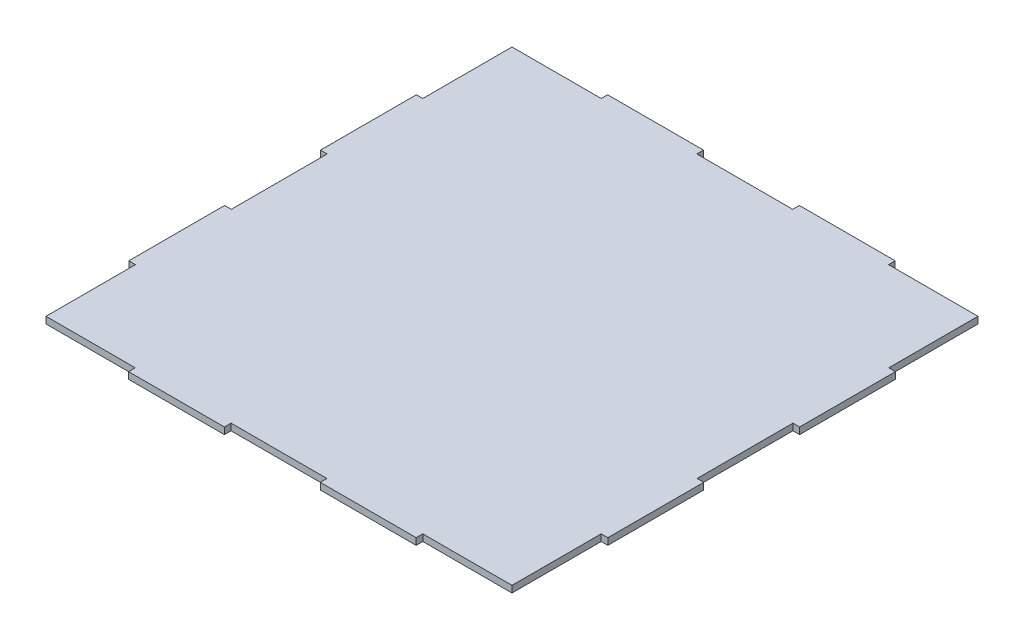
ISO-10303-21;
HEADER;
FILE_DESCRIPTION(('STEP AP214'),'2;1');
FILE_NAME('part.step','',(''),(''),'','','');
FILE_SCHEMA(('AUTOMOTIVE_DESIGN { 1 0 10303 214 1 1 1 1 }'));
ENDSEC;
DATA;
#1=APPLICATION_CONTEXT('core data for automotive mechanical design processes');
#2=APPLICATION_PROTOCOL_DEFINITION('international standard','automotive_design',2000,#1);
#3=PRODUCT_CONTEXT('',#1,'mechanical');
#4=PRODUCT('Part','Part','',(#3));
#5=PRODUCT_RELATED_PRODUCT_CATEGORY('part','',(#4));
#6=PRODUCT_DEFINITION_FORMATION('','',#4);
#7=PRODUCT_DEFINITION_CONTEXT('part definition',#1,'design');
#8=PRODUCT_DEFINITION('design','',#6,#7);
#9=PRODUCT_DEFINITION_SHAPE('','',#8);
#10=(LENGTH_UNIT() NAMED_UNIT(*) SI_UNIT(.MILLI.,.METRE.));
#11=(NAMED_UNIT(*) PLANE_ANGLE_UNIT() SI_UNIT($,.RADIAN.));
#12=(NAMED_UNIT(*) SI_UNIT($,.STERADIAN.) SOLID_ANGLE_UNIT());
#13=UNCERTAINTY_MEASURE_WITH_UNIT(LENGTH_MEASURE(1.E-05),#10,'distance_accuracy_value','');
#14=(GEOMETRIC_REPRESENTATION_CONTEXT(3) GLOBAL_UNCERTAINTY_ASSIGNED_CONTEXT((#13)) GLOBAL_UNIT_ASSIGNED_CONTEXT((#10,
#11,#12)) REPRESENTATION_CONTEXT('',''));
#15=CARTESIAN_POINT('',(0.,0.,0.));
#16=DIRECTION('',(0.,0.,1.));
#17=DIRECTION('',(1.,0.,0.));
#18=AXIS2_PLACEMENT_3D('',#15,#16,#17);
#19=CARTESIAN_POINT('',(114.3,3.175,-114.3));
#20=DIRECTION('',(0.,0.,1.));
#21=DIRECTION('',(1.,0.,0.));
#22=AXIS2_PLACEMENT_3D('',#19,#20,#21);
#23=PLANE('',#22);
#24=DIRECTION('',(-1.,0.,0.));
#25=VECTOR('',#24,1.);
#26=CARTESIAN_POINT('',(114.3,0.,-114.3));
#27=LINE('',#26,#25);
#28=CARTESIAN_POINT('',(68.4752787902901,0.,-114.3));
#29=VERTEX_POINT('',#28);
#30=CARTESIAN_POINT('',(22.7552787902901,0.,-114.3));
#31=VERTEX_POINT('',#30);
#32=EDGE_CURVE('E312',#29,#31,#27,.T.);
#33=ORIENTED_EDGE('',*,*,#32,.T.);
#34=DIRECTION('',(0.,1.,0.));
#35=VECTOR('',#34,1.);
#36=CARTESIAN_POINT('',(22.7552787902901,-3.175,-114.3));
#37=LINE('',#36,#35);
#38=CARTESIAN_POINT('',(22.7552787902901,3.175,-114.3));
#39=VERTEX_POINT('',#38);
#40=EDGE_CURVE('E399',#31,#39,#37,.T.);
#41=ORIENTED_EDGE('',*,*,#40,.T.);
#42=DIRECTION('',(-1.,0.,0.));
#43=VECTOR('',#42,1.);
#44=CARTESIAN_POINT('',(114.3,3.175,-114.3));
#45=LINE('',#44,#43);
#46=CARTESIAN_POINT('',(68.4752787902901,3.175,-114.3));
#47=VERTEX_POINT('',#46);
#48=EDGE_CURVE('E290',#47,#39,#45,.T.);
#49=ORIENTED_EDGE('',*,*,#48,.F.);
#50=DIRECTION('',(0.,1.,0.));
#51=VECTOR('',#50,1.);
#52=CARTESIAN_POINT('',(68.4752787902901,-3.175,-114.3));
#53=LINE('',#52,#51);
#54=EDGE_CURVE('E535',#29,#47,#53,.T.);
#55=ORIENTED_EDGE('',*,*,#54,.F.);
#56=EDGE_LOOP('',(#33,#41,#49,#55));
#57=FACE_BOUND('',#56,.T.);
#58=ADVANCED_FACE('F34',(#57),#23,.F.);
#59=CARTESIAN_POINT('',(114.3,3.175,114.3));
#60=DIRECTION('',(-1.,0.,0.));
#61=DIRECTION('',(0.,0.,1.));
#62=AXIS2_PLACEMENT_3D('',#59,#60,#61);
#63=PLANE('',#62);
#64=DIRECTION('',(0.,0.,-1.));
#65=VECTOR('',#64,1.);
#66=CARTESIAN_POINT('',(114.3,3.175,114.3));
#67=LINE('',#66,#65);
#68=CARTESIAN_POINT('',(114.3,3.175,-22.86));
#69=VERTEX_POINT('',#68);
#70=CARTESIAN_POINT('',(114.3,3.175,-68.5800000000001));
#71=VERTEX_POINT('',#70);
#72=EDGE_CURVE('E296',#69,#71,#67,.T.);
#73=ORIENTED_EDGE('',*,*,#72,.F.);
#74=DIRECTION('',(0.,1.,0.));
#75=VECTOR('',#74,1.);
#76=CARTESIAN_POINT('',(114.3,-3.175,-22.86));
#77=LINE('',#76,#75);
#78=CARTESIAN_POINT('',(114.3,0.,-22.86));
#79=VERTEX_POINT('',#78);
#80=EDGE_CURVE('E414',#79,#69,#77,.T.);
#81=ORIENTED_EDGE('',*,*,#80,.F.);
#82=DIRECTION('',(0.,0.,-1.));
#83=VECTOR('',#82,1.);
#84=CARTESIAN_POINT('',(114.3,0.,114.3));
#85=LINE('',#84,#83);
#86=CARTESIAN_POINT('',(114.3,0.,-68.5800000000001));
#87=VERTEX_POINT('',#86);
#88=EDGE_CURVE('E307',#79,#87,#85,.T.);
#89=ORIENTED_EDGE('',*,*,#88,.T.);
#90=DIRECTION('',(0.,1.,0.));
#91=VECTOR('',#90,1.);
#92=CARTESIAN_POINT('',(114.3,-3.175,-68.5800000000001));
#93=LINE('',#92,#91);
#94=EDGE_CURVE('E537',#87,#71,#93,.T.);
#95=ORIENTED_EDGE('',*,*,#94,.T.);
#96=EDGE_LOOP('',(#73,#81,#89,#95));
#97=FACE_BOUND('',#96,.T.);
#98=ADVANCED_FACE('F594',(#97),#63,.F.);
#99=CARTESIAN_POINT('',(-114.3,3.175,114.3));
#100=DIRECTION('',(1.,0.,0.));
#101=DIRECTION('',(0.,0.,-1.));
#102=AXIS2_PLACEMENT_3D('',#99,#100,#101);
#103=PLANE('',#102);
#104=DIRECTION('',(0.,0.,1.));
#105=VECTOR('',#104,1.);
#106=CARTESIAN_POINT('',(-114.3,3.175,114.3));
#107=LINE('',#106,#105);
#108=CARTESIAN_POINT('',(-114.299999999999,3.175,22.7552787902902));
#109=VERTEX_POINT('',#108);
#110=CARTESIAN_POINT('',(-114.3,3.175,68.4752787902901));
#111=VERTEX_POINT('',#110);
#112=EDGE_CURVE('E315',#109,#111,#107,.T.);
#113=ORIENTED_EDGE('',*,*,#112,.F.);
#114=DIRECTION('',(0.,1.,0.));
#115=VECTOR('',#114,1.);
#116=CARTESIAN_POINT('',(-114.299999999999,-3.175,22.7552787902902));
#117=LINE('',#116,#115);
#118=CARTESIAN_POINT('',(-114.299999999999,0.,22.7552787902902));
#119=VERTEX_POINT('',#118);
#120=EDGE_CURVE('E477',#119,#109,#117,.T.);
#121=ORIENTED_EDGE('',*,*,#120,.F.);
#122=DIRECTION('',(0.,0.,1.));
#123=VECTOR('',#122,1.);
#124=CARTESIAN_POINT('',(-114.3,0.,114.3));
#125=LINE('',#124,#123);
#126=CARTESIAN_POINT('',(-114.3,0.,68.4752787902901));
#127=VERTEX_POINT('',#126);
#128=EDGE_CURVE('E303',#119,#127,#125,.T.);
#129=ORIENTED_EDGE('',*,*,#128,.T.);
#130=DIRECTION('',(0.,1.,0.));
#131=VECTOR('',#130,1.);
#132=CARTESIAN_POINT('',(-114.3,-3.175,68.4752787902901));
#133=LINE('',#132,#131);
#134=EDGE_CURVE('E515',#127,#111,#133,.T.);
#135=ORIENTED_EDGE('',*,*,#134,.T.);
#136=EDGE_LOOP('',(#113,#121,#129,#135));
#137=FACE_BOUND('',#136,.T.);
#138=ADVANCED_FACE('F628',(#137),#103,.F.);
#139=CARTESIAN_POINT('',(114.3,3.175,114.3));
#140=DIRECTION('',(0.,0.,-1.));
#141=DIRECTION('',(-1.,0.,0.));
#142=AXIS2_PLACEMENT_3D('',#139,#140,#141);
#143=PLANE('',#142);
#144=DIRECTION('',(1.,0.,0.));
#145=VECTOR('',#144,1.);
#146=CARTESIAN_POINT('',(114.3,0.,114.3));
#147=LINE('',#146,#145);
#148=CARTESIAN_POINT('',(-68.58,0.,114.3));
#149=VERTEX_POINT('',#148);
#150=CARTESIAN_POINT('',(-22.86,0.,114.3));
#151=VERTEX_POINT('',#150);
#152=EDGE_CURVE('E304',#149,#151,#147,.T.);
#153=ORIENTED_EDGE('',*,*,#152,.T.);
#154=DIRECTION('',(0.,1.,0.));
#155=VECTOR('',#154,1.);
#156=CARTESIAN_POINT('',(-22.86,-3.175,114.3));
#157=LINE('',#156,#155);
#158=CARTESIAN_POINT('',(-22.86,3.175,114.3));
#159=VERTEX_POINT('',#158);
#160=EDGE_CURVE('E490',#151,#159,#157,.T.);
#161=ORIENTED_EDGE('',*,*,#160,.T.);
#162=DIRECTION('',(1.,0.,0.));
#163=VECTOR('',#162,1.);
#164=CARTESIAN_POINT('',(114.3,3.175,114.3));
#165=LINE('',#164,#163);
#166=CARTESIAN_POINT('',(-68.58,3.175,114.3));
#167=VERTEX_POINT('',#166);
#168=EDGE_CURVE('E547',#167,#159,#165,.T.);
#169=ORIENTED_EDGE('',*,*,#168,.F.);
#170=DIRECTION('',(0.,1.,0.));
#171=VECTOR('',#170,1.);
#172=CARTESIAN_POINT('',(-68.58,-3.175,114.3));
#173=LINE('',#172,#171);
#174=EDGE_CURVE('E512',#149,#167,#173,.T.);
#175=ORIENTED_EDGE('',*,*,#174,.F.);
#176=EDGE_LOOP('',(#153,#161,#169,#175));
#177=FACE_BOUND('',#176,.T.);
#178=ADVANCED_FACE('F640',(#177),#143,.F.);
#179=CARTESIAN_POINT('',(-114.3,3.175,-68.68472120971));
#180=VERTEX_POINT('',#179);
#181=CARTESIAN_POINT('',(-114.299999999999,3.175,-22.9647212097099));
#182=VERTEX_POINT('',#181);
#183=EDGE_CURVE('E545',#180,#182,#107,.T.);
#184=ORIENTED_EDGE('',*,*,#183,.F.);
#185=DIRECTION('',(0.,-1.,0.));
#186=VECTOR('',#185,1.);
#187=CARTESIAN_POINT('',(-114.3,3.175,-68.68472120971));
#188=LINE('',#187,#186);
#189=CARTESIAN_POINT('',(-114.3,0.,-68.68472120971));
#190=VERTEX_POINT('',#189);
#191=EDGE_CURVE('E457',#180,#190,#188,.T.);
#192=ORIENTED_EDGE('',*,*,#191,.T.);
#193=CARTESIAN_POINT('',(-114.3,0.,-22.9647212097099));
#194=VERTEX_POINT('',#193);
#195=EDGE_CURVE('E300',#190,#194,#125,.T.);
#196=ORIENTED_EDGE('',*,*,#195,.T.);
#197=DIRECTION('',(0.,1.,0.));
#198=VECTOR('',#197,1.);
#199=CARTESIAN_POINT('',(-114.299999999999,-3.175,-22.9647212097099));
#200=LINE('',#199,#198);
#201=EDGE_CURVE('E479',#194,#182,#200,.T.);
#202=ORIENTED_EDGE('',*,*,#201,.T.);
#203=EDGE_LOOP('',(#184,#192,#196,#202));
#204=FACE_BOUND('',#203,.T.);
#205=ADVANCED_FACE('F36',(#204),#103,.F.);
#206=CARTESIAN_POINT('',(22.86,0.,114.3));
#207=VERTEX_POINT('',#206);
#208=CARTESIAN_POINT('',(68.58,0.,114.3));
#209=VERTEX_POINT('',#208);
#210=EDGE_CURVE('E302',#207,#209,#147,.T.);
#211=ORIENTED_EDGE('',*,*,#210,.T.);
#212=DIRECTION('',(0.,1.,0.));
#213=VECTOR('',#212,1.);
#214=CARTESIAN_POINT('',(68.58,-3.175,114.3));
#215=LINE('',#214,#213);
#216=CARTESIAN_POINT('',(68.58,3.175,114.3));
#217=VERTEX_POINT('',#216);
#218=EDGE_CURVE('E440',#209,#217,#215,.T.);
#219=ORIENTED_EDGE('',*,*,#218,.T.);
#220=CARTESIAN_POINT('',(22.86,3.175,114.3));
#221=VERTEX_POINT('',#220);
#222=EDGE_CURVE('E546',#221,#217,#165,.T.);
#223=ORIENTED_EDGE('',*,*,#222,.F.);
#224=DIRECTION('',(0.,1.,0.));
#225=VECTOR('',#224,1.);
#226=CARTESIAN_POINT('',(22.86,-3.175,114.3));
#227=LINE('',#226,#225);
#228=EDGE_CURVE('E496',#207,#221,#227,.T.);
#229=ORIENTED_EDGE('',*,*,#228,.F.);
#230=EDGE_LOOP('',(#211,#219,#223,#229));
#231=FACE_BOUND('',#230,.T.);
#232=ADVANCED_FACE('F561',(#231),#143,.F.);
#233=CARTESIAN_POINT('',(114.3,0.,68.5799999999999));
#234=VERTEX_POINT('',#233);
#235=CARTESIAN_POINT('',(114.3,0.,22.86));
#236=VERTEX_POINT('',#235);
#237=EDGE_CURVE('E308',#234,#236,#85,.T.);
#238=ORIENTED_EDGE('',*,*,#237,.T.);
#239=DIRECTION('',(0.,1.,0.));
#240=VECTOR('',#239,1.);
#241=CARTESIAN_POINT('',(114.3,-3.175,22.86));
#242=LINE('',#241,#240);
#243=CARTESIAN_POINT('',(114.3,3.175,22.86));
#244=VERTEX_POINT('',#243);
#245=EDGE_CURVE('E417',#236,#244,#242,.T.);
#246=ORIENTED_EDGE('',*,*,#245,.T.);
#247=CARTESIAN_POINT('',(114.3,3.175,68.5799999999999));
#248=VERTEX_POINT('',#247);
#249=EDGE_CURVE('E291',#248,#244,#67,.T.);
#250=ORIENTED_EDGE('',*,*,#249,.F.);
#251=DIRECTION('',(0.,1.,0.));
#252=VECTOR('',#251,1.);
#253=CARTESIAN_POINT('',(114.3,-3.175,68.5799999999999));
#254=LINE('',#253,#252);
#255=EDGE_CURVE('E438',#234,#248,#254,.T.);
#256=ORIENTED_EDGE('',*,*,#255,.F.);
#257=EDGE_LOOP('',(#238,#246,#250,#256));
#258=FACE_BOUND('',#257,.T.);
#259=ADVANCED_FACE('F579',(#258),#63,.F.);
#260=CARTESIAN_POINT('',(-22.9647212097099,3.175,-114.3));
#261=VERTEX_POINT('',#260);
#262=CARTESIAN_POINT('',(-68.6847212097096,3.175,-114.3));
#263=VERTEX_POINT('',#262);
#264=EDGE_CURVE('E281',#261,#263,#45,.T.);
#265=ORIENTED_EDGE('',*,*,#264,.F.);
#266=DIRECTION('',(0.,1.,0.));
#267=VECTOR('',#266,1.);
#268=CARTESIAN_POINT('',(-22.9647212097099,-3.175,-114.3));
#269=LINE('',#268,#267);
#270=CARTESIAN_POINT('',(-22.9647212097099,0.,-114.3));
#271=VERTEX_POINT('',#270);
#272=EDGE_CURVE('E265',#271,#261,#269,.T.);
#273=ORIENTED_EDGE('',*,*,#272,.F.);
#274=CARTESIAN_POINT('',(-68.6847212097096,0.,-114.3));
#275=VERTEX_POINT('',#274);
#276=EDGE_CURVE('E311',#271,#275,#27,.T.);
#277=ORIENTED_EDGE('',*,*,#276,.T.);
#278=DIRECTION('',(0.,1.,0.));
#279=VECTOR('',#278,1.);
#280=CARTESIAN_POINT('',(-68.6847212097096,-3.175,-114.3));
#281=LINE('',#280,#279);
#282=EDGE_CURVE('E289',#275,#263,#281,.T.);
#283=ORIENTED_EDGE('',*,*,#282,.T.);
#284=EDGE_LOOP('',(#265,#273,#277,#283));
#285=FACE_BOUND('',#284,.T.);
#286=ADVANCED_FACE('F287',(#285),#23,.F.);
#287=CARTESIAN_POINT('',(0.,3.175,0.));
#288=DIRECTION('',(0.,1.,0.));
#289=DIRECTION('',(0.,0.,1.));
#290=AXIS2_PLACEMENT_3D('',#287,#288,#289);
#291=PLANE('',#290);
#292=DIRECTION('',(0.,0.,-1.));
#293=VECTOR('',#292,1.);
#294=CARTESIAN_POINT('',(22.7552787902901,3.175,-114.3));
#295=LINE('',#294,#293);
#296=CARTESIAN_POINT('',(22.7552787902901,3.175,-111.125));
#297=VERTEX_POINT('',#296);
#298=EDGE_CURVE('E275',#297,#39,#295,.T.);
#299=ORIENTED_EDGE('',*,*,#298,.F.);
#300=DIRECTION('',(1.,0.,0.));
#301=VECTOR('',#300,1.);
#302=CARTESIAN_POINT('',(-22.9647212097099,3.175,-111.125));
#303=LINE('',#302,#301);
#304=CARTESIAN_POINT('',(-22.9647212097099,3.175,-111.125));
#305=VERTEX_POINT('',#304);
#306=EDGE_CURVE('E284',#305,#297,#303,.T.);
#307=ORIENTED_EDGE('',*,*,#306,.F.);
#308=DIRECTION('',(0.,0.,1.));
#309=VECTOR('',#308,1.);
#310=CARTESIAN_POINT('',(-22.9647212097099,3.175,-114.3));
#311=LINE('',#310,#309);
#312=EDGE_CURVE('E268',#261,#305,#311,.T.);
#313=ORIENTED_EDGE('',*,*,#312,.F.);
#314=ORIENTED_EDGE('',*,*,#264,.T.);
#315=DIRECTION('',(0.,0.,-1.));
#316=VECTOR('',#315,1.);
#317=CARTESIAN_POINT('',(-68.6847212097096,3.175,-111.22972120971));
#318=LINE('',#317,#316);
#319=CARTESIAN_POINT('',(-68.6847212097096,3.175,-111.22972120971));
#320=VERTEX_POINT('',#319);
#321=EDGE_CURVE('E446',#320,#263,#318,.T.);
#322=ORIENTED_EDGE('',*,*,#321,.F.);
#323=DIRECTION('',(1.,0.,0.));
#324=VECTOR('',#323,1.);
#325=CARTESIAN_POINT('',(-68.6847212097096,3.175,-111.22972120971));
#326=LINE('',#325,#324);
#327=CARTESIAN_POINT('',(-111.229721209707,3.175,-111.22972120971));
#328=VERTEX_POINT('',#327);
#329=EDGE_CURVE('E435',#328,#320,#326,.T.);
#330=ORIENTED_EDGE('',*,*,#329,.F.);
#331=DIRECTION('',(0.,0.,-1.));
#332=VECTOR('',#331,1.);
#333=CARTESIAN_POINT('',(-111.229721209707,3.175,-111.22972120971));
#334=LINE('',#333,#332);
#335=CARTESIAN_POINT('',(-111.229721209707,3.175,-68.68472120971));
#336=VERTEX_POINT('',#335);
#337=EDGE_CURVE('E451',#336,#328,#334,.T.);
#338=ORIENTED_EDGE('',*,*,#337,.F.);
#339=DIRECTION('',(1.,0.,0.));
#340=VECTOR('',#339,1.);
#341=CARTESIAN_POINT('',(-111.229721209707,3.175,-68.68472120971));
#342=LINE('',#341,#340);
#343=EDGE_CURVE('E448',#180,#336,#342,.T.);
#344=ORIENTED_EDGE('',*,*,#343,.F.);
#345=ORIENTED_EDGE('',*,*,#183,.T.);
#346=DIRECTION('',(-1.,0.,0.));
#347=VECTOR('',#346,1.);
#348=CARTESIAN_POINT('',(-111.125000000008,3.175,-22.9647212097099));
#349=LINE('',#348,#347);
#350=CARTESIAN_POINT('',(-111.125000000008,3.175,-22.9647212097099));
#351=VERTEX_POINT('',#350);
#352=EDGE_CURVE('E467',#351,#182,#349,.T.);
#353=ORIENTED_EDGE('',*,*,#352,.F.);
#354=DIRECTION('',(0.,0.,-1.));
#355=VECTOR('',#354,1.);
#356=CARTESIAN_POINT('',(-111.125000000008,3.175,-22.9647212097099));
#357=LINE('',#356,#355);
#358=CARTESIAN_POINT('',(-111.125000000008,3.175,22.7552787902902));
#359=VERTEX_POINT('',#358);
#360=EDGE_CURVE('E464',#359,#351,#357,.T.);
#361=ORIENTED_EDGE('',*,*,#360,.F.);
#362=DIRECTION('',(1.,0.,0.));
#363=VECTOR('',#362,1.);
#364=CARTESIAN_POINT('',(-111.125000000008,3.175,22.7552787902902));
#365=LINE('',#364,#363);
#366=EDGE_CURVE('E470',#109,#359,#365,.T.);
#367=ORIENTED_EDGE('',*,*,#366,.F.);
#368=ORIENTED_EDGE('',*,*,#112,.T.);
#369=DIRECTION('',(-1.,0.,0.));
#370=VECTOR('',#369,1.);
#371=CARTESIAN_POINT('',(-111.125,3.175,68.4752787902901));
#372=LINE('',#371,#370);
#373=CARTESIAN_POINT('',(-111.125,3.175,68.4752787902901));
#374=VERTEX_POINT('',#373);
#375=EDGE_CURVE('E508',#374,#111,#372,.T.);
#376=ORIENTED_EDGE('',*,*,#375,.F.);
#377=DIRECTION('',(0.,0.,-1.));
#378=VECTOR('',#377,1.);
#379=CARTESIAN_POINT('',(-111.125,3.175,68.4752787902901));
#380=LINE('',#379,#378);
#381=CARTESIAN_POINT('',(-111.125,3.175,111.125));
#382=VERTEX_POINT('',#381);
#383=EDGE_CURVE('E505',#382,#374,#380,.T.);
#384=ORIENTED_EDGE('',*,*,#383,.F.);
#385=DIRECTION('',(-1.,0.,0.));
#386=VECTOR('',#385,1.);
#387=CARTESIAN_POINT('',(-111.125,3.175,111.125));
#388=LINE('',#387,#386);
#389=CARTESIAN_POINT('',(-68.58,3.175,111.125));
#390=VERTEX_POINT('',#389);
#391=EDGE_CURVE('E502',#390,#382,#388,.T.);
#392=ORIENTED_EDGE('',*,*,#391,.F.);
#393=DIRECTION('',(0.,0.,-1.));
#394=VECTOR('',#393,1.);
#395=CARTESIAN_POINT('',(-68.58,3.175,111.125));
#396=LINE('',#395,#394);
#397=EDGE_CURVE('E493',#167,#390,#396,.T.);
#398=ORIENTED_EDGE('',*,*,#397,.F.);
#399=ORIENTED_EDGE('',*,*,#168,.T.);
#400=DIRECTION('',(0.,0.,1.));
#401=VECTOR('',#400,1.);
#402=CARTESIAN_POINT('',(-22.86,3.175,114.3));
#403=LINE('',#402,#401);
#404=CARTESIAN_POINT('',(-22.86,3.175,111.125));
#405=VERTEX_POINT('',#404);
#406=EDGE_CURVE('E476',#405,#159,#403,.T.);
#407=ORIENTED_EDGE('',*,*,#406,.F.);
#408=DIRECTION('',(-1.,0.,0.));
#409=VECTOR('',#408,1.);
#410=CARTESIAN_POINT('',(-22.86,3.175,111.125));
#411=LINE('',#410,#409);
#412=CARTESIAN_POINT('',(22.86,3.175,111.125));
#413=VERTEX_POINT('',#412);
#414=EDGE_CURVE('E487',#413,#405,#411,.T.);
#415=ORIENTED_EDGE('',*,*,#414,.F.);
#416=DIRECTION('',(0.,0.,-1.));
#417=VECTOR('',#416,1.);
#418=CARTESIAN_POINT('',(22.86,3.175,114.3));
#419=LINE('',#418,#417);
#420=EDGE_CURVE('E484',#221,#413,#419,.T.);
#421=ORIENTED_EDGE('',*,*,#420,.F.);
#422=ORIENTED_EDGE('',*,*,#222,.T.);
#423=DIRECTION('',(0.,0.,1.));
#424=VECTOR('',#423,1.);
#425=CARTESIAN_POINT('',(68.58,3.175,111.125));
#426=LINE('',#425,#424);
#427=CARTESIAN_POINT('',(68.58,3.175,111.125));
#428=VERTEX_POINT('',#427);
#429=EDGE_CURVE('E424',#428,#217,#426,.T.);
#430=ORIENTED_EDGE('',*,*,#429,.F.);
#431=DIRECTION('',(-1.,0.,0.));
#432=VECTOR('',#431,1.);
#433=CARTESIAN_POINT('',(68.58,3.175,111.125));
#434=LINE('',#433,#432);
#435=CARTESIAN_POINT('',(111.125,3.175,111.125));
#436=VERTEX_POINT('',#435);
#437=EDGE_CURVE('E416',#436,#428,#434,.T.);
#438=ORIENTED_EDGE('',*,*,#437,.F.);
#439=DIRECTION('',(0.,0.,1.));
#440=VECTOR('',#439,1.);
#441=CARTESIAN_POINT('',(111.125,3.175,111.125));
#442=LINE('',#441,#440);
#443=CARTESIAN_POINT('',(111.125,3.175,68.5799999999999));
#444=VERTEX_POINT('',#443);
#445=EDGE_CURVE('E429',#444,#436,#442,.T.);
#446=ORIENTED_EDGE('',*,*,#445,.F.);
#447=DIRECTION('',(-1.,0.,0.));
#448=VECTOR('',#447,1.);
#449=CARTESIAN_POINT('',(111.125,3.175,68.5799999999999));
#450=LINE('',#449,#448);
#451=EDGE_CURVE('E426',#248,#444,#450,.T.);
#452=ORIENTED_EDGE('',*,*,#451,.F.);
#453=ORIENTED_EDGE('',*,*,#249,.T.);
#454=DIRECTION('',(1.,0.,0.));
#455=VECTOR('',#454,1.);
#456=CARTESIAN_POINT('',(111.125,3.175,22.86));
#457=LINE('',#456,#455);
#458=CARTESIAN_POINT('',(111.125,3.175,22.86));
#459=VERTEX_POINT('',#458);
#460=EDGE_CURVE('E411',#459,#244,#457,.T.);
#461=ORIENTED_EDGE('',*,*,#460,.F.);
#462=DIRECTION('',(0.,0.,1.));
#463=VECTOR('',#462,1.);
#464=CARTESIAN_POINT('',(111.125,3.175,-22.86));
#465=LINE('',#464,#463);
#466=CARTESIAN_POINT('',(111.125,3.175,-22.86));
#467=VERTEX_POINT('',#466);
#468=EDGE_CURVE('E409',#467,#459,#465,.T.);
#469=ORIENTED_EDGE('',*,*,#468,.F.);
#470=DIRECTION('',(-1.,0.,0.));
#471=VECTOR('',#470,1.);
#472=CARTESIAN_POINT('',(111.125,3.175,-22.86));
#473=LINE('',#472,#471);
#474=EDGE_CURVE('E402',#69,#467,#473,.T.);
#475=ORIENTED_EDGE('',*,*,#474,.F.);
#476=ORIENTED_EDGE('',*,*,#72,.T.);
#477=DIRECTION('',(1.,0.,0.));
#478=VECTOR('',#477,1.);
#479=CARTESIAN_POINT('',(114.3,3.175,-68.5800000000001));
#480=LINE('',#479,#478);
#481=CARTESIAN_POINT('',(111.125,3.175,-68.5800000000001));
#482=VERTEX_POINT('',#481);
#483=EDGE_CURVE('E531',#482,#71,#480,.T.);
#484=ORIENTED_EDGE('',*,*,#483,.F.);
#485=DIRECTION('',(0.,0.,1.));
#486=VECTOR('',#485,1.);
#487=CARTESIAN_POINT('',(111.125,3.175,-68.5800000000001));
#488=LINE('',#487,#486);
#489=CARTESIAN_POINT('',(111.125,3.175,-111.125));
#490=VERTEX_POINT('',#489);
#491=EDGE_CURVE('E528',#490,#482,#488,.T.);
#492=ORIENTED_EDGE('',*,*,#491,.F.);
#493=DIRECTION('',(1.,0.,0.));
#494=VECTOR('',#493,1.);
#495=CARTESIAN_POINT('',(68.4752787902901,3.175,-111.125));
#496=LINE('',#495,#494);
#497=CARTESIAN_POINT('',(68.4752787902901,3.175,-111.125));
#498=VERTEX_POINT('',#497);
#499=EDGE_CURVE('E525',#498,#490,#496,.T.);
#500=ORIENTED_EDGE('',*,*,#499,.F.);
#501=DIRECTION('',(0.,0.,1.));
#502=VECTOR('',#501,1.);
#503=CARTESIAN_POINT('',(68.4752787902901,3.175,-111.125));
#504=LINE('',#503,#502);
#505=EDGE_CURVE('E514',#47,#498,#504,.T.);
#506=ORIENTED_EDGE('',*,*,#505,.F.);
#507=ORIENTED_EDGE('',*,*,#48,.T.);
#508=EDGE_LOOP('',(#299,#307,#313,#314,#322,#330,#338,#344,#345,#353,#361,#367,#368,#376,#384,
#392,#398,#399,#407,#415,#421,#422,#430,#438,#446,#452,#453,#461,#469,#475,#476,#484,#492,#500,
#506,#507));
#509=FACE_BOUND('',#508,.T.);
#510=ADVANCED_FACE('F279',(#509),#291,.T.);
#511=CARTESIAN_POINT('',(0.,0.,0.));
#512=DIRECTION('',(0.,1.,0.));
#513=DIRECTION('',(0.,0.,1.));
#514=AXIS2_PLACEMENT_3D('',#511,#512,#513);
#515=PLANE('',#514);
#516=DIRECTION('',(1.,0.,0.));
#517=VECTOR('',#516,1.);
#518=CARTESIAN_POINT('',(0.,0.,-111.125));
#519=LINE('',#518,#517);
#520=CARTESIAN_POINT('',(-22.9647212097099,0.,-111.125));
#521=VERTEX_POINT('',#520);
#522=CARTESIAN_POINT('',(22.7552787902901,0.,-111.125));
#523=VERTEX_POINT('',#522);
#524=EDGE_CURVE('E42',#521,#523,#519,.T.);
#525=ORIENTED_EDGE('',*,*,#524,.T.);
#526=DIRECTION('',(0.,0.,-1.));
#527=VECTOR('',#526,1.);
#528=CARTESIAN_POINT('',(22.7552787902901,0.,0.));
#529=LINE('',#528,#527);
#530=EDGE_CURVE('E11',#523,#31,#529,.T.);
#531=ORIENTED_EDGE('',*,*,#530,.T.);
#532=ORIENTED_EDGE('',*,*,#32,.F.);
#533=DIRECTION('',(0.,0.,1.));
#534=VECTOR('',#533,1.);
#535=CARTESIAN_POINT('',(68.4752787902896,0.,2.99302484766164E-13));
#536=LINE('',#535,#534);
#537=CARTESIAN_POINT('',(68.4752787902901,0.,-111.125));
#538=VERTEX_POINT('',#537);
#539=EDGE_CURVE('E324',#29,#538,#536,.T.);
#540=ORIENTED_EDGE('',*,*,#539,.T.);
#541=DIRECTION('',(1.,0.,0.));
#542=VECTOR('',#541,1.);
#543=CARTESIAN_POINT('',(0.,0.,-111.125));
#544=LINE('',#543,#542);
#545=CARTESIAN_POINT('',(111.125,0.,-111.125));
#546=VERTEX_POINT('',#545);
#547=EDGE_CURVE('E294',#538,#546,#544,.T.);
#548=ORIENTED_EDGE('',*,*,#547,.T.);
#549=DIRECTION('',(0.,0.,1.));
#550=VECTOR('',#549,1.);
#551=CARTESIAN_POINT('',(111.125,0.,0.));
#552=LINE('',#551,#550);
#553=CARTESIAN_POINT('',(111.125,0.,-68.5800000000001));
#554=VERTEX_POINT('',#553);
#555=EDGE_CURVE('E318',#546,#554,#552,.T.);
#556=ORIENTED_EDGE('',*,*,#555,.T.);
#557=DIRECTION('',(1.,0.,0.));
#558=VECTOR('',#557,1.);
#559=CARTESIAN_POINT('',(0.,0.,-68.5800000000001));
#560=LINE('',#559,#558);
#561=EDGE_CURVE('E321',#554,#87,#560,.T.);
#562=ORIENTED_EDGE('',*,*,#561,.T.);
#563=ORIENTED_EDGE('',*,*,#88,.F.);
#564=DIRECTION('',(-1.,0.,0.));
#565=VECTOR('',#564,1.);
#566=CARTESIAN_POINT('',(0.,0.,-22.8599999999997));
#567=LINE('',#566,#565);
#568=CARTESIAN_POINT('',(111.125,0.,-22.86));
#569=VERTEX_POINT('',#568);
#570=EDGE_CURVE('E387',#79,#569,#567,.T.);
#571=ORIENTED_EDGE('',*,*,#570,.T.);
#572=DIRECTION('',(0.,0.,1.));
#573=VECTOR('',#572,1.);
#574=CARTESIAN_POINT('',(111.125,0.,-2.36115139785732E-13));
#575=LINE('',#574,#573);
#576=CARTESIAN_POINT('',(111.125,0.,22.86));
#577=VERTEX_POINT('',#576);
#578=EDGE_CURVE('E381',#569,#577,#575,.T.);
#579=ORIENTED_EDGE('',*,*,#578,.T.);
#580=DIRECTION('',(1.,0.,0.));
#581=VECTOR('',#580,1.);
#582=CARTESIAN_POINT('',(0.,0.,22.8600000000002));
#583=LINE('',#582,#581);
#584=EDGE_CURVE('E384',#577,#236,#583,.T.);
#585=ORIENTED_EDGE('',*,*,#584,.T.);
#586=ORIENTED_EDGE('',*,*,#237,.F.);
#587=DIRECTION('',(-1.,0.,0.));
#588=VECTOR('',#587,1.);
#589=CARTESIAN_POINT('',(0.,0.,68.5799999999999));
#590=LINE('',#589,#588);
#591=CARTESIAN_POINT('',(111.125,0.,68.5799999999999));
#592=VERTEX_POINT('',#591);
#593=EDGE_CURVE('E378',#234,#592,#590,.T.);
#594=ORIENTED_EDGE('',*,*,#593,.T.);
#595=DIRECTION('',(0.,0.,1.));
#596=VECTOR('',#595,1.);
#597=CARTESIAN_POINT('',(111.125,0.,0.));
#598=LINE('',#597,#596);
#599=CARTESIAN_POINT('',(111.125,0.,111.125));
#600=VERTEX_POINT('',#599);
#601=EDGE_CURVE('E375',#592,#600,#598,.T.);
#602=ORIENTED_EDGE('',*,*,#601,.T.);
#603=DIRECTION('',(-1.,0.,0.));
#604=VECTOR('',#603,1.);
#605=CARTESIAN_POINT('',(0.,0.,111.125));
#606=LINE('',#605,#604);
#607=CARTESIAN_POINT('',(68.58,0.,111.125));
#608=VERTEX_POINT('',#607);
#609=EDGE_CURVE('E372',#600,#608,#606,.T.);
#610=ORIENTED_EDGE('',*,*,#609,.T.);
#611=DIRECTION('',(0.,0.,1.));
#612=VECTOR('',#611,1.);
#613=CARTESIAN_POINT('',(68.58,0.,0.));
#614=LINE('',#613,#612);
#615=EDGE_CURVE('E369',#608,#209,#614,.T.);
#616=ORIENTED_EDGE('',*,*,#615,.T.);
#617=ORIENTED_EDGE('',*,*,#210,.F.);
#618=DIRECTION('',(0.,0.,-1.));
#619=VECTOR('',#618,1.);
#620=CARTESIAN_POINT('',(22.86,0.,0.));
#621=LINE('',#620,#619);
#622=CARTESIAN_POINT('',(22.86,0.,111.125));
#623=VERTEX_POINT('',#622);
#624=EDGE_CURVE('E339',#207,#623,#621,.T.);
#625=ORIENTED_EDGE('',*,*,#624,.T.);
#626=DIRECTION('',(-1.,0.,0.));
#627=VECTOR('',#626,1.);
#628=CARTESIAN_POINT('',(0.,0.,111.125));
#629=LINE('',#628,#627);
#630=CARTESIAN_POINT('',(-22.86,0.,111.125));
#631=VERTEX_POINT('',#630);
#632=EDGE_CURVE('E342',#623,#631,#629,.T.);
#633=ORIENTED_EDGE('',*,*,#632,.T.);
#634=DIRECTION('',(0.,0.,1.));
#635=VECTOR('',#634,1.);
#636=CARTESIAN_POINT('',(-22.86,0.,0.));
#637=LINE('',#636,#635);
#638=EDGE_CURVE('E345',#631,#151,#637,.T.);
#639=ORIENTED_EDGE('',*,*,#638,.T.);
#640=ORIENTED_EDGE('',*,*,#152,.F.);
#641=DIRECTION('',(0.,0.,-1.));
#642=VECTOR('',#641,1.);
#643=CARTESIAN_POINT('',(-68.58,0.,0.));
#644=LINE('',#643,#642);
#645=CARTESIAN_POINT('',(-68.58,0.,111.125));
#646=VERTEX_POINT('',#645);
#647=EDGE_CURVE('E336',#149,#646,#644,.T.);
#648=ORIENTED_EDGE('',*,*,#647,.T.);
#649=DIRECTION('',(-1.,0.,0.));
#650=VECTOR('',#649,1.);
#651=CARTESIAN_POINT('',(0.,0.,111.125));
#652=LINE('',#651,#650);
#653=CARTESIAN_POINT('',(-111.125,0.,111.125));
#654=VERTEX_POINT('',#653);
#655=EDGE_CURVE('E327',#646,#654,#652,.T.);
#656=ORIENTED_EDGE('',*,*,#655,.T.);
#657=DIRECTION('',(0.,0.,-1.));
#658=VECTOR('',#657,1.);
#659=CARTESIAN_POINT('',(-111.125,0.,0.));
#660=LINE('',#659,#658);
#661=CARTESIAN_POINT('',(-111.125,0.,68.4752787902901));
#662=VERTEX_POINT('',#661);
#663=EDGE_CURVE('E330',#654,#662,#660,.T.);
#664=ORIENTED_EDGE('',*,*,#663,.T.);
#665=DIRECTION('',(-1.,0.,0.));
#666=VECTOR('',#665,1.);
#667=CARTESIAN_POINT('',(0.,0.,68.4752787902901));
#668=LINE('',#667,#666);
#669=EDGE_CURVE('E333',#662,#127,#668,.T.);
#670=ORIENTED_EDGE('',*,*,#669,.T.);
#671=ORIENTED_EDGE('',*,*,#128,.F.);
#672=DIRECTION('',(1.,0.,0.));
#673=VECTOR('',#672,1.);
#674=CARTESIAN_POINT('',(0.,0.,22.7552787902902));
#675=LINE('',#674,#673);
#676=CARTESIAN_POINT('',(-111.125000000008,0.,22.7552787902902));
#677=VERTEX_POINT('',#676);
#678=EDGE_CURVE('E354',#119,#677,#675,.T.);
#679=ORIENTED_EDGE('',*,*,#678,.T.);
#680=DIRECTION('',(0.,0.,-1.));
#681=VECTOR('',#680,1.);
#682=CARTESIAN_POINT('',(-111.125000000008,0.,0.));
#683=LINE('',#682,#681);
#684=CARTESIAN_POINT('',(-111.125000000008,0.,-22.9647212097099));
#685=VERTEX_POINT('',#684);
#686=EDGE_CURVE('E351',#677,#685,#683,.T.);
#687=ORIENTED_EDGE('',*,*,#686,.T.);
#688=DIRECTION('',(-1.,0.,0.));
#689=VECTOR('',#688,1.);
#690=CARTESIAN_POINT('',(0.,0.,-22.9647212097099));
#691=LINE('',#690,#689);
#692=EDGE_CURVE('E348',#685,#194,#691,.T.);
#693=ORIENTED_EDGE('',*,*,#692,.T.);
#694=ORIENTED_EDGE('',*,*,#195,.F.);
#695=DIRECTION('',(1.,0.,0.));
#696=VECTOR('',#695,1.);
#697=CARTESIAN_POINT('',(0.,0.,-68.68472120971));
#698=LINE('',#697,#696);
#699=CARTESIAN_POINT('',(-111.229721209707,0.,-68.68472120971));
#700=VERTEX_POINT('',#699);
#701=EDGE_CURVE('E366',#190,#700,#698,.T.);
#702=ORIENTED_EDGE('',*,*,#701,.T.);
#703=DIRECTION('',(0.,0.,-1.));
#704=VECTOR('',#703,1.);
#705=CARTESIAN_POINT('',(-111.229721209707,0.,0.));
#706=LINE('',#705,#704);
#707=CARTESIAN_POINT('',(-111.229721209707,0.,-111.22972120971));
#708=VERTEX_POINT('',#707);
#709=EDGE_CURVE('E363',#700,#708,#706,.T.);
#710=ORIENTED_EDGE('',*,*,#709,.T.);
#711=DIRECTION('',(1.,0.,0.));
#712=VECTOR('',#711,1.);
#713=CARTESIAN_POINT('',(0.,0.,-111.22972120971));
#714=LINE('',#713,#712);
#715=CARTESIAN_POINT('',(-68.6847212097096,0.,-111.22972120971));
#716=VERTEX_POINT('',#715);
#717=EDGE_CURVE('E360',#708,#716,#714,.T.);
#718=ORIENTED_EDGE('',*,*,#717,.T.);
#719=DIRECTION('',(0.,0.,-1.));
#720=VECTOR('',#719,1.);
#721=CARTESIAN_POINT('',(-68.6847212097096,0.,0.));
#722=LINE('',#721,#720);
#723=EDGE_CURVE('E357',#716,#275,#722,.T.);
#724=ORIENTED_EDGE('',*,*,#723,.T.);
#725=ORIENTED_EDGE('',*,*,#276,.F.);
#726=DIRECTION('',(0.,0.,1.));
#727=VECTOR('',#726,1.);
#728=CARTESIAN_POINT('',(-22.9647212097099,0.,0.));
#729=LINE('',#728,#727);
#730=EDGE_CURVE('E271',#271,#521,#729,.T.);
#731=ORIENTED_EDGE('',*,*,#730,.T.);
#732=EDGE_LOOP('',(#525,#531,#532,#540,#548,#556,#562,#563,#571,#579,#585,#586,#594,#602,#610,
#616,#617,#625,#633,#639,#640,#648,#656,#664,#670,#671,#679,#687,#693,#694,#702,#710,#718,#724,
#725,#731));
#733=FACE_BOUND('',#732,.T.);
#734=ADVANCED_FACE('F392',(#733),#515,.F.);
#735=CARTESIAN_POINT('',(68.4752787902901,-3.175,-111.125));
#736=DIRECTION('',(-1.,0.,0.));
#737=DIRECTION('',(0.,0.,1.));
#738=AXIS2_PLACEMENT_3D('',#735,#736,#737);
#739=PLANE('',#738);
#740=ORIENTED_EDGE('',*,*,#54,.T.);
#741=ORIENTED_EDGE('',*,*,#505,.T.);
#742=DIRECTION('',(0.,1.,0.));
#743=VECTOR('',#742,1.);
#744=CARTESIAN_POINT('',(68.4752787902901,-3.175,-111.125));
#745=LINE('',#744,#743);
#746=EDGE_CURVE('E534',#538,#498,#745,.T.);
#747=ORIENTED_EDGE('',*,*,#746,.F.);
#748=ORIENTED_EDGE('',*,*,#539,.F.);
#749=EDGE_LOOP('',(#740,#741,#747,#748));
#750=FACE_BOUND('',#749,.T.);
#751=ADVANCED_FACE('F610',(#750),#739,.F.);
#752=CARTESIAN_POINT('',(114.3,-3.175,-68.5800000000001));
#753=DIRECTION('',(0.,0.,1.));
#754=DIRECTION('',(1.,0.,0.));
#755=AXIS2_PLACEMENT_3D('',#752,#753,#754);
#756=PLANE('',#755);
#757=DIRECTION('',(0.,1.,0.));
#758=VECTOR('',#757,1.);
#759=CARTESIAN_POINT('',(111.125,-3.175,-68.5800000000001));
#760=LINE('',#759,#758);
#761=EDGE_CURVE('E540',#554,#482,#760,.T.);
#762=ORIENTED_EDGE('',*,*,#761,.T.);
#763=ORIENTED_EDGE('',*,*,#483,.T.);
#764=ORIENTED_EDGE('',*,*,#94,.F.);
#765=ORIENTED_EDGE('',*,*,#561,.F.);
#766=EDGE_LOOP('',(#762,#763,#764,#765));
#767=FACE_BOUND('',#766,.T.);
#768=ADVANCED_FACE('F597',(#767),#756,.F.);
#769=CARTESIAN_POINT('',(111.125,-3.175,-68.5800000000001));
#770=DIRECTION('',(-1.,0.,0.));
#771=DIRECTION('',(0.,0.,1.));
#772=AXIS2_PLACEMENT_3D('',#769,#770,#771);
#773=PLANE('',#772);
#774=DIRECTION('',(0.,1.,0.));
#775=VECTOR('',#774,1.);
#776=CARTESIAN_POINT('',(111.125,-3.175,-111.125));
#777=LINE('',#776,#775);
#778=EDGE_CURVE('E542',#546,#490,#777,.T.);
#779=ORIENTED_EDGE('',*,*,#778,.T.);
#780=ORIENTED_EDGE('',*,*,#491,.T.);
#781=ORIENTED_EDGE('',*,*,#761,.F.);
#782=ORIENTED_EDGE('',*,*,#555,.F.);
#783=EDGE_LOOP('',(#779,#780,#781,#782));
#784=FACE_BOUND('',#783,.T.);
#785=ADVANCED_FACE('F601',(#784),#773,.F.);
#786=CARTESIAN_POINT('',(68.4752787902901,-3.175,-111.125));
#787=DIRECTION('',(0.,0.,1.));
#788=DIRECTION('',(1.,0.,0.));
#789=AXIS2_PLACEMENT_3D('',#786,#787,#788);
#790=PLANE('',#789);
#791=ORIENTED_EDGE('',*,*,#746,.T.);
#792=ORIENTED_EDGE('',*,*,#499,.T.);
#793=ORIENTED_EDGE('',*,*,#778,.F.);
#794=ORIENTED_EDGE('',*,*,#547,.F.);
#795=EDGE_LOOP('',(#791,#792,#793,#794));
#796=FACE_BOUND('',#795,.T.);
#797=ADVANCED_FACE('F607',(#796),#790,.F.);
#798=CARTESIAN_POINT('',(-68.58,-3.175,111.125));
#799=DIRECTION('',(1.,0.,0.));
#800=DIRECTION('',(0.,0.,-1.));
#801=AXIS2_PLACEMENT_3D('',#798,#799,#800);
#802=PLANE('',#801);
#803=ORIENTED_EDGE('',*,*,#174,.T.);
#804=ORIENTED_EDGE('',*,*,#397,.T.);
#805=DIRECTION('',(0.,1.,0.));
#806=VECTOR('',#805,1.);
#807=CARTESIAN_POINT('',(-68.58,-3.175,111.125));
#808=LINE('',#807,#806);
#809=EDGE_CURVE('E511',#646,#390,#808,.T.);
#810=ORIENTED_EDGE('',*,*,#809,.F.);
#811=ORIENTED_EDGE('',*,*,#647,.F.);
#812=EDGE_LOOP('',(#803,#804,#810,#811));
#813=FACE_BOUND('',#812,.T.);
#814=ADVANCED_FACE('F680',(#813),#802,.F.);
#815=CARTESIAN_POINT('',(-111.125,-3.175,68.4752787902901));
#816=DIRECTION('',(0.,0.,-1.));
#817=DIRECTION('',(-1.,0.,0.));
#818=AXIS2_PLACEMENT_3D('',#815,#816,#817);
#819=PLANE('',#818);
#820=DIRECTION('',(0.,1.,0.));
#821=VECTOR('',#820,1.);
#822=CARTESIAN_POINT('',(-111.125,-3.175,68.4752787902901));
#823=LINE('',#822,#821);
#824=EDGE_CURVE('E518',#662,#374,#823,.T.);
#825=ORIENTED_EDGE('',*,*,#824,.T.);
#826=ORIENTED_EDGE('',*,*,#375,.T.);
#827=ORIENTED_EDGE('',*,*,#134,.F.);
#828=ORIENTED_EDGE('',*,*,#669,.F.);
#829=EDGE_LOOP('',(#825,#826,#827,#828));
#830=FACE_BOUND('',#829,.T.);
#831=ADVANCED_FACE('F676',(#830),#819,.F.);
#832=CARTESIAN_POINT('',(-111.125,-3.175,68.4752787902901));
#833=DIRECTION('',(1.,0.,0.));
#834=DIRECTION('',(0.,0.,-1.));
#835=AXIS2_PLACEMENT_3D('',#832,#833,#834);
#836=PLANE('',#835);
#837=DIRECTION('',(0.,1.,0.));
#838=VECTOR('',#837,1.);
#839=CARTESIAN_POINT('',(-111.125,-3.175,111.125));
#840=LINE('',#839,#838);
#841=EDGE_CURVE('E520',#654,#382,#840,.T.);
#842=ORIENTED_EDGE('',*,*,#841,.T.);
#843=ORIENTED_EDGE('',*,*,#383,.T.);
#844=ORIENTED_EDGE('',*,*,#824,.F.);
#845=ORIENTED_EDGE('',*,*,#663,.F.);
#846=EDGE_LOOP('',(#842,#843,#844,#845));
#847=FACE_BOUND('',#846,.T.);
#848=ADVANCED_FACE('F679',(#847),#836,.F.);
#849=CARTESIAN_POINT('',(-111.125,-3.175,111.125));
#850=DIRECTION('',(0.,0.,-1.));
#851=DIRECTION('',(-1.,0.,0.));
#852=AXIS2_PLACEMENT_3D('',#849,#850,#851);
#853=PLANE('',#852);
#854=ORIENTED_EDGE('',*,*,#809,.T.);
#855=ORIENTED_EDGE('',*,*,#391,.T.);
#856=ORIENTED_EDGE('',*,*,#841,.F.);
#857=ORIENTED_EDGE('',*,*,#655,.F.);
#858=EDGE_LOOP('',(#854,#855,#856,#857));
#859=FACE_BOUND('',#858,.T.);
#860=ADVANCED_FACE('F675',(#859),#853,.F.);
#861=CARTESIAN_POINT('',(-22.86,-3.175,114.3));
#862=DIRECTION('',(-1.,0.,0.));
#863=DIRECTION('',(0.,0.,1.));
#864=AXIS2_PLACEMENT_3D('',#861,#862,#863);
#865=PLANE('',#864);
#866=DIRECTION('',(0.,1.,0.));
#867=VECTOR('',#866,1.);
#868=CARTESIAN_POINT('',(-22.86,-3.175,111.125));
#869=LINE('',#868,#867);
#870=EDGE_CURVE('E491',#631,#405,#869,.T.);
#871=ORIENTED_EDGE('',*,*,#870,.T.);
#872=ORIENTED_EDGE('',*,*,#406,.T.);
#873=ORIENTED_EDGE('',*,*,#160,.F.);
#874=ORIENTED_EDGE('',*,*,#638,.F.);
#875=EDGE_LOOP('',(#871,#872,#873,#874));
#876=FACE_BOUND('',#875,.T.);
#877=ADVANCED_FACE('F656',(#876),#865,.F.);
#878=CARTESIAN_POINT('',(-22.86,-3.175,111.125));
#879=DIRECTION('',(0.,0.,-1.));
#880=DIRECTION('',(-1.,0.,0.));
#881=AXIS2_PLACEMENT_3D('',#878,#879,#880);
#882=PLANE('',#881);
#883=DIRECTION('',(0.,1.,0.));
#884=VECTOR('',#883,1.);
#885=CARTESIAN_POINT('',(22.86,-3.175,111.125));
#886=LINE('',#885,#884);
#887=EDGE_CURVE('E494',#623,#413,#886,.T.);
#888=ORIENTED_EDGE('',*,*,#887,.T.);
#889=ORIENTED_EDGE('',*,*,#414,.T.);
#890=ORIENTED_EDGE('',*,*,#870,.F.);
#891=ORIENTED_EDGE('',*,*,#632,.F.);
#892=EDGE_LOOP('',(#888,#889,#890,#891));
#893=FACE_BOUND('',#892,.T.);
#894=ADVANCED_FACE('F658',(#893),#882,.F.);
#895=CARTESIAN_POINT('',(22.86,-3.175,114.3));
#896=DIRECTION('',(1.,0.,0.));
#897=DIRECTION('',(0.,0.,-1.));
#898=AXIS2_PLACEMENT_3D('',#895,#896,#897);
#899=PLANE('',#898);
#900=ORIENTED_EDGE('',*,*,#228,.T.);
#901=ORIENTED_EDGE('',*,*,#420,.T.);
#902=ORIENTED_EDGE('',*,*,#887,.F.);
#903=ORIENTED_EDGE('',*,*,#624,.F.);
#904=EDGE_LOOP('',(#900,#901,#902,#903));
#905=FACE_BOUND('',#904,.T.);
#906=ADVANCED_FACE('F660',(#905),#899,.F.);
#907=CARTESIAN_POINT('',(-111.125000000008,-3.175,-22.9647212097099));
#908=DIRECTION('',(1.,0.,0.));
#909=DIRECTION('',(0.,0.,-1.));
#910=AXIS2_PLACEMENT_3D('',#907,#908,#909);
#911=PLANE('',#910);
#912=DIRECTION('',(0.,1.,0.));
#913=VECTOR('',#912,1.);
#914=CARTESIAN_POINT('',(-111.125000000008,-3.175,22.7552787902902));
#915=LINE('',#914,#913);
#916=EDGE_CURVE('E474',#677,#359,#915,.T.);
#917=ORIENTED_EDGE('',*,*,#916,.T.);
#918=ORIENTED_EDGE('',*,*,#360,.T.);
#919=DIRECTION('',(0.,1.,0.));
#920=VECTOR('',#919,1.);
#921=CARTESIAN_POINT('',(-111.125000000008,-3.175,-22.9647212097099));
#922=LINE('',#921,#920);
#923=EDGE_CURVE('E473',#685,#351,#922,.T.);
#924=ORIENTED_EDGE('',*,*,#923,.F.);
#925=ORIENTED_EDGE('',*,*,#686,.F.);
#926=EDGE_LOOP('',(#917,#918,#924,#925));
#927=FACE_BOUND('',#926,.T.);
#928=ADVANCED_FACE('F662',(#927),#911,.F.);
#929=CARTESIAN_POINT('',(-111.125000000008,-3.175,22.7552787902902));
#930=DIRECTION('',(0.,0.,1.));
#931=DIRECTION('',(1.,0.,0.));
#932=AXIS2_PLACEMENT_3D('',#929,#930,#931);
#933=PLANE('',#932);
#934=ORIENTED_EDGE('',*,*,#120,.T.);
#935=ORIENTED_EDGE('',*,*,#366,.T.);
#936=ORIENTED_EDGE('',*,*,#916,.F.);
#937=ORIENTED_EDGE('',*,*,#678,.F.);
#938=EDGE_LOOP('',(#934,#935,#936,#937));
#939=FACE_BOUND('',#938,.T.);
#940=ADVANCED_FACE('F668',(#939),#933,.F.);
#941=CARTESIAN_POINT('',(-111.125000000008,-3.175,-22.9647212097099));
#942=DIRECTION('',(0.,0.,-1.));
#943=DIRECTION('',(-1.,0.,0.));
#944=AXIS2_PLACEMENT_3D('',#941,#942,#943);
#945=PLANE('',#944);
#946=ORIENTED_EDGE('',*,*,#923,.T.);
#947=ORIENTED_EDGE('',*,*,#352,.T.);
#948=ORIENTED_EDGE('',*,*,#201,.F.);
#949=ORIENTED_EDGE('',*,*,#692,.F.);
#950=EDGE_LOOP('',(#946,#947,#948,#949));
#951=FACE_BOUND('',#950,.T.);
#952=ADVANCED_FACE('F762',(#951),#945,.F.);
#953=CARTESIAN_POINT('',(-68.6847212097096,-3.175,-111.22972120971));
#954=DIRECTION('',(0.,0.,1.));
#955=DIRECTION('',(1.,0.,0.));
#956=AXIS2_PLACEMENT_3D('',#953,#954,#955);
#957=PLANE('',#956);
#958=DIRECTION('',(0.,1.,0.));
#959=VECTOR('',#958,1.);
#960=CARTESIAN_POINT('',(-111.229721209707,-3.175,-111.22972120971));
#961=LINE('',#960,#959);
#962=EDGE_CURVE('E455',#708,#328,#961,.T.);
#963=ORIENTED_EDGE('',*,*,#962,.T.);
#964=ORIENTED_EDGE('',*,*,#329,.T.);
#965=DIRECTION('',(0.,1.,0.));
#966=VECTOR('',#965,1.);
#967=CARTESIAN_POINT('',(-68.6847212097096,-3.175,-111.22972120971));
#968=LINE('',#967,#966);
#969=EDGE_CURVE('E454',#716,#320,#968,.T.);
#970=ORIENTED_EDGE('',*,*,#969,.F.);
#971=ORIENTED_EDGE('',*,*,#717,.F.);
#972=EDGE_LOOP('',(#963,#964,#970,#971));
#973=FACE_BOUND('',#972,.T.);
#974=ADVANCED_FACE('F772',(#973),#957,.F.);
#975=CARTESIAN_POINT('',(-111.229721209707,-3.175,-111.22972120971));
#976=DIRECTION('',(1.,0.,0.));
#977=DIRECTION('',(0.,0.,-1.));
#978=AXIS2_PLACEMENT_3D('',#975,#976,#977);
#979=PLANE('',#978);
#980=DIRECTION('',(0.,1.,0.));
#981=VECTOR('',#980,1.);
#982=CARTESIAN_POINT('',(-111.229721209707,-3.175,-68.68472120971));
#983=LINE('',#982,#981);
#984=EDGE_CURVE('E458',#700,#336,#983,.T.);
#985=ORIENTED_EDGE('',*,*,#984,.T.);
#986=ORIENTED_EDGE('',*,*,#337,.T.);
#987=ORIENTED_EDGE('',*,*,#962,.F.);
#988=ORIENTED_EDGE('',*,*,#709,.F.);
#989=EDGE_LOOP('',(#985,#986,#987,#988));
#990=FACE_BOUND('',#989,.T.);
#991=ADVANCED_FACE('F782',(#990),#979,.F.);
#992=CARTESIAN_POINT('',(-111.229721209707,-3.175,-68.68472120971));
#993=DIRECTION('',(0.,0.,1.));
#994=DIRECTION('',(1.,0.,0.));
#995=AXIS2_PLACEMENT_3D('',#992,#993,#994);
#996=PLANE('',#995);
#997=ORIENTED_EDGE('',*,*,#343,.T.);
#998=ORIENTED_EDGE('',*,*,#984,.F.);
#999=ORIENTED_EDGE('',*,*,#701,.F.);
#1000=ORIENTED_EDGE('',*,*,#191,.F.);
#1001=EDGE_LOOP('',(#997,#998,#999,#1000));
#1002=FACE_BOUND('',#1001,.T.);
#1003=ADVANCED_FACE('F792',(#1002),#996,.F.);
#1004=CARTESIAN_POINT('',(-68.6847212097096,-3.175,-111.22972120971));
#1005=DIRECTION('',(1.,0.,0.));
#1006=DIRECTION('',(0.,0.,-1.));
#1007=AXIS2_PLACEMENT_3D('',#1004,#1005,#1006);
#1008=PLANE('',#1007);
#1009=ORIENTED_EDGE('',*,*,#969,.T.);
#1010=ORIENTED_EDGE('',*,*,#321,.T.);
#1011=ORIENTED_EDGE('',*,*,#282,.F.);
#1012=ORIENTED_EDGE('',*,*,#723,.F.);
#1013=EDGE_LOOP('',(#1009,#1010,#1011,#1012));
#1014=FACE_BOUND('',#1013,.T.);
#1015=ADVANCED_FACE('F802',(#1014),#1008,.F.);
#1016=CARTESIAN_POINT('',(68.58,-3.175,111.125));
#1017=DIRECTION('',(0.,0.,-1.));
#1018=DIRECTION('',(-1.,0.,0.));
#1019=AXIS2_PLACEMENT_3D('',#1016,#1017,#1018);
#1020=PLANE('',#1019);
#1021=DIRECTION('',(0.,1.,0.));
#1022=VECTOR('',#1021,1.);
#1023=CARTESIAN_POINT('',(111.125,-3.175,111.125));
#1024=LINE('',#1023,#1022);
#1025=EDGE_CURVE('E433',#600,#436,#1024,.T.);
#1026=ORIENTED_EDGE('',*,*,#1025,.T.);
#1027=ORIENTED_EDGE('',*,*,#437,.T.);
#1028=DIRECTION('',(0.,1.,0.));
#1029=VECTOR('',#1028,1.);
#1030=CARTESIAN_POINT('',(68.58,-3.175,111.125));
#1031=LINE('',#1030,#1029);
#1032=EDGE_CURVE('E432',#608,#428,#1031,.T.);
#1033=ORIENTED_EDGE('',*,*,#1032,.F.);
#1034=ORIENTED_EDGE('',*,*,#609,.F.);
#1035=EDGE_LOOP('',(#1026,#1027,#1033,#1034));
#1036=FACE_BOUND('',#1035,.T.);
#1037=ADVANCED_FACE('F568',(#1036),#1020,.F.);
#1038=CARTESIAN_POINT('',(111.125,-3.175,111.125));
#1039=DIRECTION('',(-1.,0.,0.));
#1040=DIRECTION('',(0.,0.,1.));
#1041=AXIS2_PLACEMENT_3D('',#1038,#1039,#1040);
#1042=PLANE('',#1041);
#1043=DIRECTION('',(0.,1.,0.));
#1044=VECTOR('',#1043,1.);
#1045=CARTESIAN_POINT('',(111.125,-3.175,68.5799999999999));
#1046=LINE('',#1045,#1044);
#1047=EDGE_CURVE('E436',#592,#444,#1046,.T.);
#1048=ORIENTED_EDGE('',*,*,#1047,.T.);
#1049=ORIENTED_EDGE('',*,*,#445,.T.);
#1050=ORIENTED_EDGE('',*,*,#1025,.F.);
#1051=ORIENTED_EDGE('',*,*,#601,.F.);
#1052=EDGE_LOOP('',(#1048,#1049,#1050,#1051));
#1053=FACE_BOUND('',#1052,.T.);
#1054=ADVANCED_FACE('F570',(#1053),#1042,.F.);
#1055=CARTESIAN_POINT('',(111.125,-3.175,68.5799999999999));
#1056=DIRECTION('',(0.,0.,-1.));
#1057=DIRECTION('',(-1.,0.,0.));
#1058=AXIS2_PLACEMENT_3D('',#1055,#1056,#1057);
#1059=PLANE('',#1058);
#1060=ORIENTED_EDGE('',*,*,#255,.T.);
#1061=ORIENTED_EDGE('',*,*,#451,.T.);
#1062=ORIENTED_EDGE('',*,*,#1047,.F.);
#1063=ORIENTED_EDGE('',*,*,#593,.F.);
#1064=EDGE_LOOP('',(#1060,#1061,#1062,#1063));
#1065=FACE_BOUND('',#1064,.T.);
#1066=ADVANCED_FACE('F829',(#1065),#1059,.F.);
#1067=CARTESIAN_POINT('',(68.58,-3.175,111.125));
#1068=DIRECTION('',(-1.,0.,0.));
#1069=DIRECTION('',(0.,0.,1.));
#1070=AXIS2_PLACEMENT_3D('',#1067,#1068,#1069);
#1071=PLANE('',#1070);
#1072=ORIENTED_EDGE('',*,*,#1032,.T.);
#1073=ORIENTED_EDGE('',*,*,#429,.T.);
#1074=ORIENTED_EDGE('',*,*,#218,.F.);
#1075=ORIENTED_EDGE('',*,*,#615,.F.);
#1076=EDGE_LOOP('',(#1072,#1073,#1074,#1075));
#1077=FACE_BOUND('',#1076,.T.);
#1078=ADVANCED_FACE('F564',(#1077),#1071,.F.);
#1079=CARTESIAN_POINT('',(111.125,-3.175,-22.86));
#1080=DIRECTION('',(0.,0.,-1.));
#1081=DIRECTION('',(-1.,0.,0.));
#1082=AXIS2_PLACEMENT_3D('',#1079,#1080,#1081);
#1083=PLANE('',#1082);
#1084=ORIENTED_EDGE('',*,*,#80,.T.);
#1085=ORIENTED_EDGE('',*,*,#474,.T.);
#1086=DIRECTION('',(0.,1.,0.));
#1087=VECTOR('',#1086,1.);
#1088=CARTESIAN_POINT('',(111.125,-3.175,-22.86));
#1089=LINE('',#1088,#1087);
#1090=EDGE_CURVE('E413',#569,#467,#1089,.T.);
#1091=ORIENTED_EDGE('',*,*,#1090,.F.);
#1092=ORIENTED_EDGE('',*,*,#570,.F.);
#1093=EDGE_LOOP('',(#1084,#1085,#1091,#1092));
#1094=FACE_BOUND('',#1093,.T.);
#1095=ADVANCED_FACE('F587',(#1094),#1083,.F.);
#1096=CARTESIAN_POINT('',(111.125,-3.175,22.86));
#1097=DIRECTION('',(0.,0.,1.));
#1098=DIRECTION('',(1.,0.,0.));
#1099=AXIS2_PLACEMENT_3D('',#1096,#1097,#1098);
#1100=PLANE('',#1099);
#1101=DIRECTION('',(0.,1.,0.));
#1102=VECTOR('',#1101,1.);
#1103=CARTESIAN_POINT('',(111.125,-3.175,22.86));
#1104=LINE('',#1103,#1102);
#1105=EDGE_CURVE('E57',#577,#459,#1104,.T.);
#1106=ORIENTED_EDGE('',*,*,#1105,.T.);
#1107=ORIENTED_EDGE('',*,*,#460,.T.);
#1108=ORIENTED_EDGE('',*,*,#245,.F.);
#1109=ORIENTED_EDGE('',*,*,#584,.F.);
#1110=EDGE_LOOP('',(#1106,#1107,#1108,#1109));
#1111=FACE_BOUND('',#1110,.T.);
#1112=ADVANCED_FACE('F582',(#1111),#1100,.F.);
#1113=CARTESIAN_POINT('',(111.125,-3.175,-22.86));
#1114=DIRECTION('',(-1.,0.,0.));
#1115=DIRECTION('',(0.,0.,1.));
#1116=AXIS2_PLACEMENT_3D('',#1113,#1114,#1115);
#1117=PLANE('',#1116);
#1118=ORIENTED_EDGE('',*,*,#1090,.T.);
#1119=ORIENTED_EDGE('',*,*,#468,.T.);
#1120=ORIENTED_EDGE('',*,*,#1105,.F.);
#1121=ORIENTED_EDGE('',*,*,#578,.F.);
#1122=EDGE_LOOP('',(#1118,#1119,#1120,#1121));
#1123=FACE_BOUND('',#1122,.T.);
#1124=ADVANCED_FACE('F585',(#1123),#1117,.F.);
#1125=CARTESIAN_POINT('',(22.7552787902901,-3.175,-114.3));
#1126=DIRECTION('',(1.,0.,0.));
#1127=DIRECTION('',(0.,0.,-1.));
#1128=AXIS2_PLACEMENT_3D('',#1125,#1126,#1127);
#1129=PLANE('',#1128);
#1130=DIRECTION('',(0.,1.,0.));
#1131=VECTOR('',#1130,1.);
#1132=CARTESIAN_POINT('',(22.7552787902901,-3.175,-111.125));
#1133=LINE('',#1132,#1131);
#1134=EDGE_CURVE('E397',#523,#297,#1133,.T.);
#1135=ORIENTED_EDGE('',*,*,#1134,.T.);
#1136=ORIENTED_EDGE('',*,*,#298,.T.);
#1137=ORIENTED_EDGE('',*,*,#40,.F.);
#1138=ORIENTED_EDGE('',*,*,#530,.F.);
#1139=EDGE_LOOP('',(#1135,#1136,#1137,#1138));
#1140=FACE_BOUND('',#1139,.T.);
#1141=ADVANCED_FACE('F614',(#1140),#1129,.F.);
#1142=CARTESIAN_POINT('',(-22.9647212097099,-3.175,-111.125));
#1143=DIRECTION('',(0.,0.,1.));
#1144=DIRECTION('',(1.,0.,0.));
#1145=AXIS2_PLACEMENT_3D('',#1142,#1143,#1144);
#1146=PLANE('',#1145);
#1147=DIRECTION('',(0.,1.,0.));
#1148=VECTOR('',#1147,1.);
#1149=CARTESIAN_POINT('',(-22.9647212097099,-3.175,-111.125));
#1150=LINE('',#1149,#1148);
#1151=EDGE_CURVE('E49',#521,#305,#1150,.T.);
#1152=ORIENTED_EDGE('',*,*,#1151,.T.);
#1153=ORIENTED_EDGE('',*,*,#306,.T.);
#1154=ORIENTED_EDGE('',*,*,#1134,.F.);
#1155=ORIENTED_EDGE('',*,*,#524,.F.);
#1156=EDGE_LOOP('',(#1152,#1153,#1154,#1155));
#1157=FACE_BOUND('',#1156,.T.);
#1158=ADVANCED_FACE('F396',(#1157),#1146,.F.);
#1159=CARTESIAN_POINT('',(-22.9647212097099,-3.175,-114.3));
#1160=DIRECTION('',(-1.,0.,0.));
#1161=DIRECTION('',(0.,0.,1.));
#1162=AXIS2_PLACEMENT_3D('',#1159,#1160,#1161);
#1163=PLANE('',#1162);
#1164=ORIENTED_EDGE('',*,*,#272,.T.);
#1165=ORIENTED_EDGE('',*,*,#312,.T.);
#1166=ORIENTED_EDGE('',*,*,#1151,.F.);
#1167=ORIENTED_EDGE('',*,*,#730,.F.);
#1168=EDGE_LOOP('',(#1164,#1165,#1166,#1167));
#1169=FACE_BOUND('',#1168,.T.);
#1170=ADVANCED_FACE('F267',(#1169),#1163,.F.);
#1171=CLOSED_SHELL('',(#58,#98,#138,#178,#205,#232,#259,#286,#510,#734,#751,#768,#785,#797,#814,
#831,#848,#860,#877,#894,#906,#928,#940,#952,#974,#991,#1003,#1015,#1037,#1054,#1066,#1078,
#1095,#1112,#1124,#1141,#1158,#1170));
#1172=MANIFOLD_SOLID_BREP('B2',#1171);
#1173=ADVANCED_BREP_SHAPE_REPRESENTATION('',(#18,#1172),#14);
#1174=SHAPE_DEFINITION_REPRESENTATION(#9,#1173);
ENDSEC;
END-ISO-10303-21;
